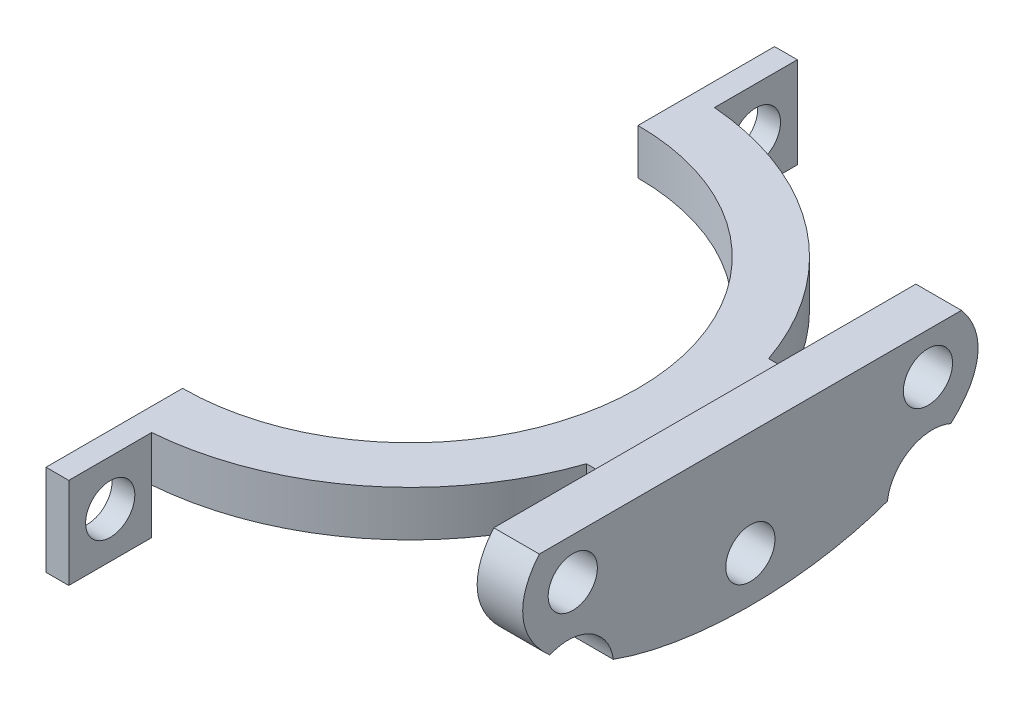
ISO-10303-21;
HEADER;
FILE_DESCRIPTION(('STEP AP214'),'2;1');
FILE_NAME('part.step','',(''),(''),'','','');
FILE_SCHEMA(('AUTOMOTIVE_DESIGN { 1 0 10303 214 1 1 1 1 }'));
ENDSEC;
DATA;
#1=APPLICATION_CONTEXT('core data for automotive mechanical design processes');
#2=APPLICATION_PROTOCOL_DEFINITION('international standard','automotive_design',2000,#1);
#3=PRODUCT_CONTEXT('',#1,'mechanical');
#4=PRODUCT('Part','Part','',(#3));
#5=PRODUCT_RELATED_PRODUCT_CATEGORY('part','',(#4));
#6=PRODUCT_DEFINITION_FORMATION('','',#4);
#7=PRODUCT_DEFINITION_CONTEXT('part definition',#1,'design');
#8=PRODUCT_DEFINITION('design','',#6,#7);
#9=PRODUCT_DEFINITION_SHAPE('','',#8);
#10=(LENGTH_UNIT() NAMED_UNIT(*) SI_UNIT(.MILLI.,.METRE.));
#11=(NAMED_UNIT(*) PLANE_ANGLE_UNIT() SI_UNIT($,.RADIAN.));
#12=(NAMED_UNIT(*) SI_UNIT($,.STERADIAN.) SOLID_ANGLE_UNIT());
#13=UNCERTAINTY_MEASURE_WITH_UNIT(LENGTH_MEASURE(1.E-05),#10,'distance_accuracy_value','');
#14=(GEOMETRIC_REPRESENTATION_CONTEXT(3) GLOBAL_UNCERTAINTY_ASSIGNED_CONTEXT((#13)) GLOBAL_UNIT_ASSIGNED_CONTEXT((#10,
#11,#12)) REPRESENTATION_CONTEXT('',''));
#15=CARTESIAN_POINT('',(0.,0.,0.));
#16=DIRECTION('',(0.,0.,1.));
#17=DIRECTION('',(1.,0.,0.));
#18=AXIS2_PLACEMENT_3D('',#15,#16,#17);
#19=CARTESIAN_POINT('',(32.3428015022424,2.5,0.));
#20=DIRECTION('',(1.,0.,0.));
#21=DIRECTION('',(0.,0.,-1.));
#22=AXIS2_PLACEMENT_3D('',#19,#20,#21);
#23=ELLIPSE('',#22,25.,12.);
#24=DIRECTION('',(1.,0.,0.));
#25=VECTOR('',#24,1.);
#26=SURFACE_OF_LINEAR_EXTRUSION('',#23,#25);
#27=DIRECTION('',(1.,0.,0.));
#28=VECTOR('',#27,1.);
#29=CARTESIAN_POINT('',(32.3428015022424,-7.08344087328634,-15.0458877139792));
#30=LINE('',#29,#28);
#31=CARTESIAN_POINT('',(37.3428015022424,-7.08344087328634,-15.0458877139792));
#32=VERTEX_POINT('',#31);
#33=CARTESIAN_POINT('',(32.3428015022424,-7.08344087328634,-15.0458877139792));
#34=VERTEX_POINT('',#33);
#35=EDGE_CURVE('E238',#32,#34,#30,.F.);
#36=ORIENTED_EDGE('',*,*,#35,.F.);
#37=CARTESIAN_POINT('',(37.3428015022424,2.5,0.));
#38=DIRECTION('',(1.,0.,0.));
#39=DIRECTION('',(0.,0.,-1.));
#40=AXIS2_PLACEMENT_3D('',#37,#38,#39);
#41=ELLIPSE('',#40,25.,12.);
#42=CARTESIAN_POINT('',(37.3428015022424,-7.08344087328633,15.0458877139792));
#43=VERTEX_POINT('',#42);
#44=EDGE_CURVE('E859',#43,#32,#41,.T.);
#45=ORIENTED_EDGE('',*,*,#44,.F.);
#46=DIRECTION('',(1.,0.,0.));
#47=VECTOR('',#46,1.);
#48=CARTESIAN_POINT('',(32.3428015022424,-7.08344087328633,15.0458877139792));
#49=LINE('',#48,#47);
#50=CARTESIAN_POINT('',(32.3428015022424,-7.08344087328633,15.0458877139792));
#51=VERTEX_POINT('',#50);
#52=EDGE_CURVE('E64',#51,#43,#49,.T.);
#53=ORIENTED_EDGE('',*,*,#52,.F.);
#54=EDGE_CURVE('E202',#51,#34,#23,.T.);
#55=ORIENTED_EDGE('',*,*,#54,.T.);
#56=EDGE_LOOP('',(#36,#45,#53,#55));
#57=FACE_BOUND('',#56,.T.);
#58=ADVANCED_FACE('F41',(#57),#26,.T.);
#59=DIRECTION('',(1.,0.,0.));
#60=VECTOR('',#59,1.);
#61=CARTESIAN_POINT('',(32.3428015022424,-3.18429291918994,22.0172767950297));
#62=LINE('',#61,#60);
#63=CARTESIAN_POINT('',(37.3428015022424,-3.18429291918995,22.0172767950297));
#64=VERTEX_POINT('',#63);
#65=CARTESIAN_POINT('',(32.3428015022424,-3.18429291918995,22.0172767950297));
#66=VERTEX_POINT('',#65);
#67=EDGE_CURVE('E182',#64,#66,#62,.F.);
#68=ORIENTED_EDGE('',*,*,#67,.F.);
#69=CARTESIAN_POINT('',(37.3428015022424,6.99999999999998,23.175620272174));
#70=VERTEX_POINT('',#69);
#71=EDGE_CURVE('E850',#70,#64,#41,.T.);
#72=ORIENTED_EDGE('',*,*,#71,.F.);
#73=DIRECTION('',(1.,0.,0.));
#74=VECTOR('',#73,1.);
#75=CARTESIAN_POINT('',(32.3428015022424,6.99999999999998,23.175620272174));
#76=LINE('',#75,#74);
#77=CARTESIAN_POINT('',(32.3428015022424,6.99999999999998,23.175620272174));
#78=VERTEX_POINT('',#77);
#79=EDGE_CURVE('E207',#78,#70,#76,.T.);
#80=ORIENTED_EDGE('',*,*,#79,.F.);
#81=EDGE_CURVE('E199',#78,#66,#23,.T.);
#82=ORIENTED_EDGE('',*,*,#81,.T.);
#83=EDGE_LOOP('',(#68,#72,#80,#82));
#84=FACE_BOUND('',#83,.T.);
#85=ADVANCED_FACE('F206',(#84),#26,.T.);
#86=CARTESIAN_POINT('',(0.,0.,0.));
#87=DIRECTION('',(0.,1.,0.));
#88=DIRECTION('',(0.,0.,1.));
#89=AXIS2_PLACEMENT_3D('',#86,#87,#88);
#90=PLANE('',#89);
#91=DIRECTION('',(0.,0.,-1.));
#92=VECTOR('',#91,1.);
#93=CARTESIAN_POINT('',(32.3428015022424,0.,0.));
#94=LINE('',#93,#92);
#95=CARTESIAN_POINT('',(32.3428015022424,0.,10.));
#96=VERTEX_POINT('',#95);
#97=CARTESIAN_POINT('',(32.3428015022424,0.,-10.));
#98=VERTEX_POINT('',#97);
#99=EDGE_CURVE('E224',#96,#98,#94,.T.);
#100=ORIENTED_EDGE('',*,*,#99,.F.);
#101=DIRECTION('',(-1.,0.,0.));
#102=VECTOR('',#101,1.);
#103=CARTESIAN_POINT('',(0.,0.,10.));
#104=LINE('',#103,#102);
#105=CARTESIAN_POINT('',(29.3428015022424,0.,10.));
#106=VERTEX_POINT('',#105);
#107=EDGE_CURVE('E342',#96,#106,#104,.T.);
#108=ORIENTED_EDGE('',*,*,#107,.T.);
#109=CARTESIAN_POINT('',(0.,0.,0.));
#110=DIRECTION('',(0.,1.,0.));
#111=DIRECTION('',(0.,0.,1.));
#112=AXIS2_PLACEMENT_3D('',#109,#110,#111);
#113=CIRCLE('',#112,31.);
#114=CARTESIAN_POINT('',(2.5,0.,30.8990291109608));
#115=VERTEX_POINT('',#114);
#116=EDGE_CURVE('E395',#115,#106,#113,.T.);
#117=ORIENTED_EDGE('',*,*,#116,.F.);
#118=DIRECTION('',(1.,0.,0.));
#119=VECTOR('',#118,1.);
#120=CARTESIAN_POINT('',(0.,0.,30.8990291109608));
#121=LINE('',#120,#119);
#122=CARTESIAN_POINT('',(0.,0.,30.8990291109608));
#123=VERTEX_POINT('',#122);
#124=EDGE_CURVE('E311',#123,#115,#121,.T.);
#125=ORIENTED_EDGE('',*,*,#124,.F.);
#126=DIRECTION('',(0.,0.,1.));
#127=VECTOR('',#126,1.);
#128=CARTESIAN_POINT('',(0.,0.,0.));
#129=LINE('',#128,#127);
#130=CARTESIAN_POINT('',(0.,0.,25.));
#131=VERTEX_POINT('',#130);
#132=EDGE_CURVE('E391',#131,#123,#129,.T.);
#133=ORIENTED_EDGE('',*,*,#132,.F.);
#134=CARTESIAN_POINT('',(0.,0.,0.));
#135=DIRECTION('',(0.,1.,0.));
#136=DIRECTION('',(0.,0.,1.));
#137=AXIS2_PLACEMENT_3D('',#134,#135,#136);
#138=CIRCLE('',#137,25.);
#139=CARTESIAN_POINT('',(0.,0.,-25.));
#140=VERTEX_POINT('',#139);
#141=EDGE_CURVE('E387',#131,#140,#138,.T.);
#142=ORIENTED_EDGE('',*,*,#141,.T.);
#143=DIRECTION('',(0.,0.,-1.));
#144=VECTOR('',#143,1.);
#145=CARTESIAN_POINT('',(0.,0.,0.));
#146=LINE('',#145,#144);
#147=CARTESIAN_POINT('',(0.,0.,-30.8990291109608));
#148=VERTEX_POINT('',#147);
#149=EDGE_CURVE('E384',#140,#148,#146,.T.);
#150=ORIENTED_EDGE('',*,*,#149,.T.);
#151=DIRECTION('',(-1.,0.,0.));
#152=VECTOR('',#151,1.);
#153=CARTESIAN_POINT('',(0.,0.,-30.8990291109608));
#154=LINE('',#153,#152);
#155=CARTESIAN_POINT('',(2.5,0.,-30.8990291109608));
#156=VERTEX_POINT('',#155);
#157=EDGE_CURVE('E274',#156,#148,#154,.T.);
#158=ORIENTED_EDGE('',*,*,#157,.F.);
#159=CARTESIAN_POINT('',(0.,0.,0.));
#160=DIRECTION('',(0.,1.,0.));
#161=DIRECTION('',(0.,0.,1.));
#162=AXIS2_PLACEMENT_3D('',#159,#160,#161);
#163=CIRCLE('',#162,31.);
#164=CARTESIAN_POINT('',(29.3428015022424,0.,-10.));
#165=VERTEX_POINT('',#164);
#166=EDGE_CURVE('E380',#165,#156,#163,.T.);
#167=ORIENTED_EDGE('',*,*,#166,.F.);
#168=DIRECTION('',(-1.,0.,0.));
#169=VECTOR('',#168,1.);
#170=CARTESIAN_POINT('',(0.,0.,-9.99999999999999));
#171=LINE('',#170,#169);
#172=EDGE_CURVE('E337',#98,#165,#171,.T.);
#173=ORIENTED_EDGE('',*,*,#172,.F.);
#174=EDGE_LOOP('',(#100,#108,#117,#125,#133,#142,#150,#158,#167,#173));
#175=FACE_BOUND('',#174,.T.);
#176=ADVANCED_FACE('F445',(#175),#90,.F.);
#177=CARTESIAN_POINT('',(0.,5.,-9.99999999999999));
#178=DIRECTION('',(0.,0.,1.));
#179=DIRECTION('',(1.,0.,0.));
#180=AXIS2_PLACEMENT_3D('',#177,#178,#179);
#181=PLANE('',#180);
#182=DIRECTION('',(0.,1.,0.));
#183=VECTOR('',#182,1.);
#184=CARTESIAN_POINT('',(32.3428015022424,0.,-10.));
#185=LINE('',#184,#183);
#186=CARTESIAN_POINT('',(32.3428015022424,5.,-10.));
#187=VERTEX_POINT('',#186);
#188=EDGE_CURVE('E229',#98,#187,#185,.T.);
#189=ORIENTED_EDGE('',*,*,#188,.F.);
#190=ORIENTED_EDGE('',*,*,#172,.T.);
#191=DIRECTION('',(0.,-1.,0.));
#192=VECTOR('',#191,1.);
#193=CARTESIAN_POINT('',(29.3428015022424,5.,-10.));
#194=LINE('',#193,#192);
#195=CARTESIAN_POINT('',(29.3428015022424,5.,-10.));
#196=VERTEX_POINT('',#195);
#197=EDGE_CURVE('E430',#196,#165,#194,.T.);
#198=ORIENTED_EDGE('',*,*,#197,.F.);
#199=DIRECTION('',(-1.,0.,0.));
#200=VECTOR('',#199,1.);
#201=CARTESIAN_POINT('',(0.,5.,-9.99999999999999));
#202=LINE('',#201,#200);
#203=EDGE_CURVE('E338',#187,#196,#202,.T.);
#204=ORIENTED_EDGE('',*,*,#203,.F.);
#205=EDGE_LOOP('',(#189,#190,#198,#204));
#206=FACE_BOUND('',#205,.T.);
#207=ADVANCED_FACE('F43',(#206),#181,.F.);
#208=CARTESIAN_POINT('',(0.,5.,10.));
#209=DIRECTION('',(0.,0.,1.));
#210=DIRECTION('',(1.,0.,0.));
#211=AXIS2_PLACEMENT_3D('',#208,#209,#210);
#212=PLANE('',#211);
#213=ORIENTED_EDGE('',*,*,#107,.F.);
#214=DIRECTION('',(0.,-1.,0.));
#215=VECTOR('',#214,1.);
#216=CARTESIAN_POINT('',(32.3428015022424,0.,10.));
#217=LINE('',#216,#215);
#218=CARTESIAN_POINT('',(32.3428015022424,5.,10.));
#219=VERTEX_POINT('',#218);
#220=EDGE_CURVE('E220',#219,#96,#217,.T.);
#221=ORIENTED_EDGE('',*,*,#220,.F.);
#222=DIRECTION('',(-1.,0.,0.));
#223=VECTOR('',#222,1.);
#224=CARTESIAN_POINT('',(0.,5.,10.));
#225=LINE('',#224,#223);
#226=CARTESIAN_POINT('',(29.3428015022424,5.,10.));
#227=VERTEX_POINT('',#226);
#228=EDGE_CURVE('E374',#219,#227,#225,.T.);
#229=ORIENTED_EDGE('',*,*,#228,.T.);
#230=DIRECTION('',(0.,-1.,0.));
#231=VECTOR('',#230,1.);
#232=CARTESIAN_POINT('',(29.3428015022424,5.,10.));
#233=LINE('',#232,#231);
#234=EDGE_CURVE('E377',#227,#106,#233,.T.);
#235=ORIENTED_EDGE('',*,*,#234,.T.);
#236=EDGE_LOOP('',(#213,#221,#229,#235));
#237=FACE_BOUND('',#236,.T.);
#238=ADVANCED_FACE('F494',(#237),#212,.T.);
#239=CARTESIAN_POINT('',(0.,5.,0.));
#240=DIRECTION('',(0.,1.,0.));
#241=DIRECTION('',(0.,0.,1.));
#242=AXIS2_PLACEMENT_3D('',#239,#240,#241);
#243=PLANE('',#242);
#244=ORIENTED_EDGE('',*,*,#228,.F.);
#245=DIRECTION('',(0.,0.,1.));
#246=VECTOR('',#245,1.);
#247=CARTESIAN_POINT('',(32.3428015022424,5.,0.));
#248=LINE('',#247,#246);
#249=EDGE_CURVE('E234',#187,#219,#248,.T.);
#250=ORIENTED_EDGE('',*,*,#249,.F.);
#251=ORIENTED_EDGE('',*,*,#203,.T.);
#252=CARTESIAN_POINT('',(0.,5.,0.));
#253=DIRECTION('',(0.,1.,0.));
#254=DIRECTION('',(0.,0.,1.));
#255=AXIS2_PLACEMENT_3D('',#252,#253,#254);
#256=CIRCLE('',#255,31.);
#257=CARTESIAN_POINT('',(2.5,5.,-30.8990291109608));
#258=VERTEX_POINT('',#257);
#259=EDGE_CURVE('E341',#196,#258,#256,.T.);
#260=ORIENTED_EDGE('',*,*,#259,.T.);
#261=DIRECTION('',(0.,0.,1.));
#262=VECTOR('',#261,1.);
#263=CARTESIAN_POINT('',(2.5,5.,0.));
#264=LINE('',#263,#262);
#265=CARTESIAN_POINT('',(2.5,5.,-40.));
#266=VERTEX_POINT('',#265);
#267=EDGE_CURVE('E345',#266,#258,#264,.T.);
#268=ORIENTED_EDGE('',*,*,#267,.F.);
#269=DIRECTION('',(1.,0.,0.));
#270=VECTOR('',#269,1.);
#271=CARTESIAN_POINT('',(0.,5.,-40.));
#272=LINE('',#271,#270);
#273=CARTESIAN_POINT('',(0.,5.,-40.));
#274=VERTEX_POINT('',#273);
#275=EDGE_CURVE('E349',#274,#266,#272,.T.);
#276=ORIENTED_EDGE('',*,*,#275,.F.);
#277=DIRECTION('',(0.,0.,-1.));
#278=VECTOR('',#277,1.);
#279=CARTESIAN_POINT('',(0.,5.,0.));
#280=LINE('',#279,#278);
#281=CARTESIAN_POINT('',(0.,5.,-25.));
#282=VERTEX_POINT('',#281);
#283=EDGE_CURVE('E353',#282,#274,#280,.T.);
#284=ORIENTED_EDGE('',*,*,#283,.F.);
#285=CARTESIAN_POINT('',(0.,5.,0.));
#286=DIRECTION('',(0.,1.,0.));
#287=DIRECTION('',(0.,0.,1.));
#288=AXIS2_PLACEMENT_3D('',#285,#286,#287);
#289=CIRCLE('',#288,25.);
#290=CARTESIAN_POINT('',(0.,5.,25.));
#291=VERTEX_POINT('',#290);
#292=EDGE_CURVE('E357',#291,#282,#289,.T.);
#293=ORIENTED_EDGE('',*,*,#292,.F.);
#294=DIRECTION('',(0.,0.,1.));
#295=VECTOR('',#294,1.);
#296=CARTESIAN_POINT('',(0.,5.,0.));
#297=LINE('',#296,#295);
#298=CARTESIAN_POINT('',(0.,5.,40.));
#299=VERTEX_POINT('',#298);
#300=EDGE_CURVE('E361',#291,#299,#297,.T.);
#301=ORIENTED_EDGE('',*,*,#300,.T.);
#302=DIRECTION('',(1.,0.,0.));
#303=VECTOR('',#302,1.);
#304=CARTESIAN_POINT('',(0.,5.,40.));
#305=LINE('',#304,#303);
#306=CARTESIAN_POINT('',(2.5,5.,40.));
#307=VERTEX_POINT('',#306);
#308=EDGE_CURVE('E364',#299,#307,#305,.T.);
#309=ORIENTED_EDGE('',*,*,#308,.T.);
#310=DIRECTION('',(0.,0.,-1.));
#311=VECTOR('',#310,1.);
#312=CARTESIAN_POINT('',(2.5,5.,0.));
#313=LINE('',#312,#311);
#314=CARTESIAN_POINT('',(2.5,5.,30.8990291109608));
#315=VERTEX_POINT('',#314);
#316=EDGE_CURVE('E367',#307,#315,#313,.T.);
#317=ORIENTED_EDGE('',*,*,#316,.T.);
#318=CARTESIAN_POINT('',(0.,5.,0.));
#319=DIRECTION('',(0.,1.,0.));
#320=DIRECTION('',(0.,0.,1.));
#321=AXIS2_PLACEMENT_3D('',#318,#319,#320);
#322=CIRCLE('',#321,31.);
#323=EDGE_CURVE('E370',#315,#227,#322,.T.);
#324=ORIENTED_EDGE('',*,*,#323,.T.);
#325=EDGE_LOOP('',(#244,#250,#251,#260,#268,#276,#284,#293,#301,#309,#317,#324));
#326=FACE_BOUND('',#325,.T.);
#327=ADVANCED_FACE('F458',(#326),#243,.T.);
#328=CARTESIAN_POINT('',(0.,5.,0.));
#329=DIRECTION('',(0.,-1.,0.));
#330=DIRECTION('',(0.,0.,-1.));
#331=AXIS2_PLACEMENT_3D('',#328,#329,#330);
#332=CYLINDRICAL_SURFACE('',#331,31.);
#333=ORIENTED_EDGE('',*,*,#166,.T.);
#334=DIRECTION('',(0.,-1.,0.));
#335=VECTOR('',#334,1.);
#336=CARTESIAN_POINT('',(2.5,5.,-30.8990291109608));
#337=LINE('',#336,#335);
#338=EDGE_CURVE('E426',#258,#156,#337,.T.);
#339=ORIENTED_EDGE('',*,*,#338,.F.);
#340=ORIENTED_EDGE('',*,*,#259,.F.);
#341=ORIENTED_EDGE('',*,*,#197,.T.);
#342=EDGE_LOOP('',(#333,#339,#340,#341));
#343=FACE_BOUND('',#342,.T.);
#344=ADVANCED_FACE('F437',(#343),#332,.T.);
#345=CARTESIAN_POINT('',(2.5,5.,0.));
#346=DIRECTION('',(1.,0.,0.));
#347=DIRECTION('',(0.,0.,-1.));
#348=AXIS2_PLACEMENT_3D('',#345,#346,#347);
#349=PLANE('',#348);
#350=CARTESIAN_POINT('',(2.5,0.,-35.4495145554804));
#351=DIRECTION('',(1.,0.,0.));
#352=DIRECTION('',(0.,0.,-1.));
#353=AXIS2_PLACEMENT_3D('',#350,#351,#352);
#354=CIRCLE('',#353,2.7);
#355=CARTESIAN_POINT('',(2.5,0.,-38.1495145554804));
#356=VERTEX_POINT('',#355);
#357=EDGE_CURVE('E275',#356,#356,#354,.F.);
#358=ORIENTED_EDGE('',*,*,#357,.T.);
#359=EDGE_LOOP('',(#358));
#360=FACE_BOUND('',#359,.T.);
#361=ORIENTED_EDGE('',*,*,#338,.T.);
#362=DIRECTION('',(0.,1.,0.));
#363=VECTOR('',#362,1.);
#364=CARTESIAN_POINT('',(2.5,-5.,-30.8990291109608));
#365=LINE('',#364,#363);
#366=CARTESIAN_POINT('',(2.5,-5.,-30.8990291109608));
#367=VERTEX_POINT('',#366);
#368=EDGE_CURVE('E307',#367,#156,#365,.T.);
#369=ORIENTED_EDGE('',*,*,#368,.F.);
#370=DIRECTION('',(0.,0.,1.));
#371=VECTOR('',#370,1.);
#372=CARTESIAN_POINT('',(2.5,-5.,-30.8990291109608));
#373=LINE('',#372,#371);
#374=CARTESIAN_POINT('',(2.5,-5.,-40.));
#375=VERTEX_POINT('',#374);
#376=EDGE_CURVE('E294',#375,#367,#373,.T.);
#377=ORIENTED_EDGE('',*,*,#376,.F.);
#378=DIRECTION('',(0.,-1.,0.));
#379=VECTOR('',#378,1.);
#380=CARTESIAN_POINT('',(2.5,5.,-40.));
#381=LINE('',#380,#379);
#382=EDGE_CURVE('E423',#266,#375,#381,.T.);
#383=ORIENTED_EDGE('',*,*,#382,.F.);
#384=ORIENTED_EDGE('',*,*,#267,.T.);
#385=EDGE_LOOP('',(#361,#369,#377,#383,#384));
#386=FACE_BOUND('',#385,.T.);
#387=ADVANCED_FACE('F451',(#360,#386),#349,.T.);
#388=CARTESIAN_POINT('',(0.,5.,-40.));
#389=DIRECTION('',(0.,0.,-1.));
#390=DIRECTION('',(-1.,0.,0.));
#391=AXIS2_PLACEMENT_3D('',#388,#389,#390);
#392=PLANE('',#391);
#393=ORIENTED_EDGE('',*,*,#382,.T.);
#394=DIRECTION('',(1.,0.,0.));
#395=VECTOR('',#394,1.);
#396=CARTESIAN_POINT('',(0.,-5.,-40.));
#397=LINE('',#396,#395);
#398=CARTESIAN_POINT('',(0.,-5.,-40.));
#399=VERTEX_POINT('',#398);
#400=EDGE_CURVE('E290',#399,#375,#397,.T.);
#401=ORIENTED_EDGE('',*,*,#400,.F.);
#402=DIRECTION('',(0.,-1.,0.));
#403=VECTOR('',#402,1.);
#404=CARTESIAN_POINT('',(0.,5.,-40.));
#405=LINE('',#404,#403);
#406=EDGE_CURVE('E420',#274,#399,#405,.T.);
#407=ORIENTED_EDGE('',*,*,#406,.F.);
#408=ORIENTED_EDGE('',*,*,#275,.T.);
#409=EDGE_LOOP('',(#393,#401,#407,#408));
#410=FACE_BOUND('',#409,.T.);
#411=ADVANCED_FACE('F461',(#410),#392,.T.);
#412=CARTESIAN_POINT('',(0.,5.,0.));
#413=DIRECTION('',(-1.,0.,0.));
#414=DIRECTION('',(0.,0.,1.));
#415=AXIS2_PLACEMENT_3D('',#412,#413,#414);
#416=PLANE('',#415);
#417=CARTESIAN_POINT('',(0.,0.,-35.4495145554804));
#418=DIRECTION('',(-1.,0.,0.));
#419=DIRECTION('',(0.,0.,1.));
#420=AXIS2_PLACEMENT_3D('',#417,#418,#419);
#421=CIRCLE('',#420,2.7);
#422=CARTESIAN_POINT('',(0.,0.,-32.7495145554804));
#423=VERTEX_POINT('',#422);
#424=EDGE_CURVE('E270',#423,#423,#421,.T.);
#425=ORIENTED_EDGE('',*,*,#424,.F.);
#426=EDGE_LOOP('',(#425));
#427=FACE_BOUND('',#426,.T.);
#428=ORIENTED_EDGE('',*,*,#149,.F.);
#429=DIRECTION('',(0.,-1.,0.));
#430=VECTOR('',#429,1.);
#431=CARTESIAN_POINT('',(0.,5.,-25.));
#432=LINE('',#431,#430);
#433=EDGE_CURVE('E417',#282,#140,#432,.T.);
#434=ORIENTED_EDGE('',*,*,#433,.F.);
#435=ORIENTED_EDGE('',*,*,#283,.T.);
#436=ORIENTED_EDGE('',*,*,#406,.T.);
#437=DIRECTION('',(0.,0.,-1.));
#438=VECTOR('',#437,1.);
#439=CARTESIAN_POINT('',(0.,-5.,-30.8990291109608));
#440=LINE('',#439,#438);
#441=CARTESIAN_POINT('',(0.,-5.,-30.8990291109608));
#442=VERTEX_POINT('',#441);
#443=EDGE_CURVE('E286',#442,#399,#440,.T.);
#444=ORIENTED_EDGE('',*,*,#443,.F.);
#445=DIRECTION('',(0.,1.,0.));
#446=VECTOR('',#445,1.);
#447=CARTESIAN_POINT('',(0.,-5.,-30.8990291109608));
#448=LINE('',#447,#446);
#449=EDGE_CURVE('E300',#442,#148,#448,.T.);
#450=ORIENTED_EDGE('',*,*,#449,.T.);
#451=EDGE_LOOP('',(#428,#434,#435,#436,#444,#450));
#452=FACE_BOUND('',#451,.T.);
#453=ADVANCED_FACE('F465',(#427,#452),#416,.T.);
#454=CARTESIAN_POINT('',(0.,5.,0.));
#455=DIRECTION('',(0.,-1.,0.));
#456=DIRECTION('',(0.,0.,-1.));
#457=AXIS2_PLACEMENT_3D('',#454,#455,#456);
#458=CYLINDRICAL_SURFACE('',#457,25.);
#459=ORIENTED_EDGE('',*,*,#141,.F.);
#460=DIRECTION('',(0.,-1.,0.));
#461=VECTOR('',#460,1.);
#462=CARTESIAN_POINT('',(0.,5.,25.));
#463=LINE('',#462,#461);
#464=EDGE_CURVE('E414',#291,#131,#463,.T.);
#465=ORIENTED_EDGE('',*,*,#464,.F.);
#466=ORIENTED_EDGE('',*,*,#292,.T.);
#467=ORIENTED_EDGE('',*,*,#433,.T.);
#468=EDGE_LOOP('',(#459,#465,#466,#467));
#469=FACE_BOUND('',#468,.T.);
#470=ADVANCED_FACE('F469',(#469),#458,.F.);
#471=CARTESIAN_POINT('',(0.,5.,0.));
#472=DIRECTION('',(1.,0.,0.));
#473=DIRECTION('',(0.,0.,-1.));
#474=AXIS2_PLACEMENT_3D('',#471,#472,#473);
#475=PLANE('',#474);
#476=CARTESIAN_POINT('',(0.,0.,35.4495145554804));
#477=DIRECTION('',(1.,0.,0.));
#478=DIRECTION('',(0.,0.,-1.));
#479=AXIS2_PLACEMENT_3D('',#476,#477,#478);
#480=CIRCLE('',#479,2.7);
#481=CARTESIAN_POINT('',(0.,0.,32.7495145554804));
#482=VERTEX_POINT('',#481);
#483=EDGE_CURVE('E263',#482,#482,#480,.T.);
#484=ORIENTED_EDGE('',*,*,#483,.T.);
#485=EDGE_LOOP('',(#484));
#486=FACE_BOUND('',#485,.T.);
#487=ORIENTED_EDGE('',*,*,#132,.T.);
#488=DIRECTION('',(0.,1.,0.));
#489=VECTOR('',#488,1.);
#490=CARTESIAN_POINT('',(0.,-5.,30.8990291109608));
#491=LINE('',#490,#489);
#492=CARTESIAN_POINT('',(0.,-5.,30.8990291109608));
#493=VERTEX_POINT('',#492);
#494=EDGE_CURVE('E333',#493,#123,#491,.T.);
#495=ORIENTED_EDGE('',*,*,#494,.F.);
#496=DIRECTION('',(0.,0.,-1.));
#497=VECTOR('',#496,1.);
#498=CARTESIAN_POINT('',(0.,-5.,30.8990291109608));
#499=LINE('',#498,#497);
#500=CARTESIAN_POINT('',(0.,-5.,40.));
#501=VERTEX_POINT('',#500);
#502=EDGE_CURVE('E320',#501,#493,#499,.T.);
#503=ORIENTED_EDGE('',*,*,#502,.F.);
#504=DIRECTION('',(0.,-1.,0.));
#505=VECTOR('',#504,1.);
#506=CARTESIAN_POINT('',(0.,5.,40.));
#507=LINE('',#506,#505);
#508=EDGE_CURVE('E411',#299,#501,#507,.T.);
#509=ORIENTED_EDGE('',*,*,#508,.F.);
#510=ORIENTED_EDGE('',*,*,#300,.F.);
#511=ORIENTED_EDGE('',*,*,#464,.T.);
#512=EDGE_LOOP('',(#487,#495,#503,#509,#510,#511));
#513=FACE_BOUND('',#512,.T.);
#514=ADVANCED_FACE('F474',(#486,#513),#475,.F.);
#515=CARTESIAN_POINT('',(0.,5.,40.));
#516=DIRECTION('',(0.,0.,-1.));
#517=DIRECTION('',(-1.,0.,0.));
#518=AXIS2_PLACEMENT_3D('',#515,#516,#517);
#519=PLANE('',#518);
#520=ORIENTED_EDGE('',*,*,#508,.T.);
#521=DIRECTION('',(-1.,0.,0.));
#522=VECTOR('',#521,1.);
#523=CARTESIAN_POINT('',(0.,-5.,40.));
#524=LINE('',#523,#522);
#525=CARTESIAN_POINT('',(2.5,-5.,40.));
#526=VERTEX_POINT('',#525);
#527=EDGE_CURVE('E316',#526,#501,#524,.T.);
#528=ORIENTED_EDGE('',*,*,#527,.F.);
#529=DIRECTION('',(0.,-1.,0.));
#530=VECTOR('',#529,1.);
#531=CARTESIAN_POINT('',(2.5,5.,40.));
#532=LINE('',#531,#530);
#533=EDGE_CURVE('E408',#307,#526,#532,.T.);
#534=ORIENTED_EDGE('',*,*,#533,.F.);
#535=ORIENTED_EDGE('',*,*,#308,.F.);
#536=EDGE_LOOP('',(#520,#528,#534,#535));
#537=FACE_BOUND('',#536,.T.);
#538=ADVANCED_FACE('F482',(#537),#519,.F.);
#539=CARTESIAN_POINT('',(2.5,5.,0.));
#540=DIRECTION('',(-1.,0.,0.));
#541=DIRECTION('',(0.,0.,1.));
#542=AXIS2_PLACEMENT_3D('',#539,#540,#541);
#543=PLANE('',#542);
#544=CARTESIAN_POINT('',(2.5,0.,35.4495145554804));
#545=DIRECTION('',(-1.,0.,0.));
#546=DIRECTION('',(0.,0.,1.));
#547=AXIS2_PLACEMENT_3D('',#544,#545,#546);
#548=CIRCLE('',#547,2.7);
#549=CARTESIAN_POINT('',(2.5,0.,38.1495145554804));
#550=VERTEX_POINT('',#549);
#551=EDGE_CURVE('E279',#550,#550,#548,.T.);
#552=ORIENTED_EDGE('',*,*,#551,.T.);
#553=EDGE_LOOP('',(#552));
#554=FACE_BOUND('',#553,.T.);
#555=ORIENTED_EDGE('',*,*,#533,.T.);
#556=DIRECTION('',(0.,0.,1.));
#557=VECTOR('',#556,1.);
#558=CARTESIAN_POINT('',(2.5,-5.,30.8990291109608));
#559=LINE('',#558,#557);
#560=CARTESIAN_POINT('',(2.5,-5.,30.8990291109608));
#561=VERTEX_POINT('',#560);
#562=EDGE_CURVE('E312',#561,#526,#559,.T.);
#563=ORIENTED_EDGE('',*,*,#562,.F.);
#564=DIRECTION('',(0.,1.,0.));
#565=VECTOR('',#564,1.);
#566=CARTESIAN_POINT('',(2.5,-5.,30.8990291109608));
#567=LINE('',#566,#565);
#568=EDGE_CURVE('E326',#561,#115,#567,.T.);
#569=ORIENTED_EDGE('',*,*,#568,.T.);
#570=DIRECTION('',(0.,-1.,0.));
#571=VECTOR('',#570,1.);
#572=CARTESIAN_POINT('',(2.5,5.,30.8990291109608));
#573=LINE('',#572,#571);
#574=EDGE_CURVE('E404',#315,#115,#573,.T.);
#575=ORIENTED_EDGE('',*,*,#574,.F.);
#576=ORIENTED_EDGE('',*,*,#316,.F.);
#577=EDGE_LOOP('',(#555,#563,#569,#575,#576));
#578=FACE_BOUND('',#577,.T.);
#579=ADVANCED_FACE('F485',(#554,#578),#543,.F.);
#580=CARTESIAN_POINT('',(0.,5.,0.));
#581=DIRECTION('',(0.,-1.,0.));
#582=DIRECTION('',(0.,0.,-1.));
#583=AXIS2_PLACEMENT_3D('',#580,#581,#582);
#584=CYLINDRICAL_SURFACE('',#583,31.);
#585=ORIENTED_EDGE('',*,*,#116,.T.);
#586=ORIENTED_EDGE('',*,*,#234,.F.);
#587=ORIENTED_EDGE('',*,*,#323,.F.);
#588=ORIENTED_EDGE('',*,*,#574,.T.);
#589=EDGE_LOOP('',(#585,#586,#587,#588));
#590=FACE_BOUND('',#589,.T.);
#591=ADVANCED_FACE('F490',(#590),#584,.T.);
#592=CARTESIAN_POINT('',(0.,-5.,30.8990291109608));
#593=DIRECTION('',(0.,0.,1.));
#594=DIRECTION('',(1.,0.,0.));
#595=AXIS2_PLACEMENT_3D('',#592,#593,#594);
#596=PLANE('',#595);
#597=ORIENTED_EDGE('',*,*,#124,.T.);
#598=ORIENTED_EDGE('',*,*,#568,.F.);
#599=DIRECTION('',(1.,0.,0.));
#600=VECTOR('',#599,1.);
#601=CARTESIAN_POINT('',(0.,-5.,30.8990291109608));
#602=LINE('',#601,#600);
#603=EDGE_CURVE('E323',#493,#561,#602,.T.);
#604=ORIENTED_EDGE('',*,*,#603,.F.);
#605=ORIENTED_EDGE('',*,*,#494,.T.);
#606=EDGE_LOOP('',(#597,#598,#604,#605));
#607=FACE_BOUND('',#606,.T.);
#608=ADVANCED_FACE('F546',(#607),#596,.F.);
#609=CARTESIAN_POINT('',(0.,-5.,0.));
#610=DIRECTION('',(0.,1.,0.));
#611=DIRECTION('',(0.,0.,1.));
#612=AXIS2_PLACEMENT_3D('',#609,#610,#611);
#613=PLANE('',#612);
#614=ORIENTED_EDGE('',*,*,#562,.T.);
#615=ORIENTED_EDGE('',*,*,#527,.T.);
#616=ORIENTED_EDGE('',*,*,#502,.T.);
#617=ORIENTED_EDGE('',*,*,#603,.T.);
#618=EDGE_LOOP('',(#614,#615,#616,#617));
#619=FACE_BOUND('',#618,.T.);
#620=ADVANCED_FACE('F543',(#619),#613,.F.);
#621=CARTESIAN_POINT('',(0.,-5.,-30.8990291109608));
#622=DIRECTION('',(0.,0.,-1.));
#623=DIRECTION('',(-1.,0.,0.));
#624=AXIS2_PLACEMENT_3D('',#621,#622,#623);
#625=PLANE('',#624);
#626=ORIENTED_EDGE('',*,*,#157,.T.);
#627=ORIENTED_EDGE('',*,*,#449,.F.);
#628=DIRECTION('',(-1.,0.,0.));
#629=VECTOR('',#628,1.);
#630=CARTESIAN_POINT('',(0.,-5.,-30.8990291109608));
#631=LINE('',#630,#629);
#632=EDGE_CURVE('E297',#367,#442,#631,.T.);
#633=ORIENTED_EDGE('',*,*,#632,.F.);
#634=ORIENTED_EDGE('',*,*,#368,.T.);
#635=EDGE_LOOP('',(#626,#627,#633,#634));
#636=FACE_BOUND('',#635,.T.);
#637=ADVANCED_FACE('F539',(#636),#625,.F.);
#638=CARTESIAN_POINT('',(0.,-5.,0.));
#639=DIRECTION('',(0.,-1.,0.));
#640=DIRECTION('',(0.,0.,-1.));
#641=AXIS2_PLACEMENT_3D('',#638,#639,#640);
#642=PLANE('',#641);
#643=ORIENTED_EDGE('',*,*,#443,.T.);
#644=ORIENTED_EDGE('',*,*,#400,.T.);
#645=ORIENTED_EDGE('',*,*,#376,.T.);
#646=ORIENTED_EDGE('',*,*,#632,.T.);
#647=EDGE_LOOP('',(#643,#644,#645,#646));
#648=FACE_BOUND('',#647,.T.);
#649=ADVANCED_FACE('F531',(#648),#642,.T.);
#650=CARTESIAN_POINT('',(37.3438015022424,0.,35.4495145554804));
#651=DIRECTION('',(-1.,0.,0.));
#652=DIRECTION('',(0.,0.,1.));
#653=AXIS2_PLACEMENT_3D('',#650,#651,#652);
#654=CYLINDRICAL_SURFACE('',#653,2.7);
#655=ORIENTED_EDGE('',*,*,#483,.F.);
#656=EDGE_LOOP('',(#655));
#657=FACE_BOUND('',#656,.T.);
#658=ORIENTED_EDGE('',*,*,#551,.F.);
#659=EDGE_LOOP('',(#658));
#660=FACE_BOUND('',#659,.T.);
#661=ADVANCED_FACE('F526',(#657,#660),#654,.F.);
#662=CARTESIAN_POINT('',(37.3438015022424,0.,-35.4495145554804));
#663=DIRECTION('',(-1.,0.,0.));
#664=DIRECTION('',(0.,0.,1.));
#665=AXIS2_PLACEMENT_3D('',#662,#663,#664);
#666=CYLINDRICAL_SURFACE('',#665,2.7);
#667=ORIENTED_EDGE('',*,*,#357,.F.);
#668=EDGE_LOOP('',(#667));
#669=FACE_BOUND('',#668,.T.);
#670=ORIENTED_EDGE('',*,*,#424,.T.);
#671=EDGE_LOOP('',(#670));
#672=FACE_BOUND('',#671,.T.);
#673=ADVANCED_FACE('F518',(#669,#672),#666,.F.);
#674=DIRECTION('',(1.,0.,0.));
#675=VECTOR('',#674,1.);
#676=CARTESIAN_POINT('',(32.3428015022424,-3.18429291918997,-22.0172767950297));
#677=LINE('',#676,#675);
#678=CARTESIAN_POINT('',(32.3428015022424,-3.18429291918996,-22.0172767950297));
#679=VERTEX_POINT('',#678);
#680=CARTESIAN_POINT('',(37.3428015022424,-3.18429291918997,-22.0172767950297));
#681=VERTEX_POINT('',#680);
#682=EDGE_CURVE('E56',#679,#681,#677,.T.);
#683=ORIENTED_EDGE('',*,*,#682,.F.);
#684=CARTESIAN_POINT('',(32.3428015022424,6.99999999999998,-23.175620272174));
#685=VERTEX_POINT('',#684);
#686=EDGE_CURVE('E212',#679,#685,#23,.T.);
#687=ORIENTED_EDGE('',*,*,#686,.T.);
#688=DIRECTION('',(1.,0.,0.));
#689=VECTOR('',#688,1.);
#690=CARTESIAN_POINT('',(32.3428015022424,6.99999999999998,-23.175620272174));
#691=LINE('',#690,#689);
#692=CARTESIAN_POINT('',(37.3428015022424,6.99999999999998,-23.175620272174));
#693=VERTEX_POINT('',#692);
#694=EDGE_CURVE('E254',#685,#693,#691,.T.);
#695=ORIENTED_EDGE('',*,*,#694,.T.);
#696=EDGE_CURVE('E241',#681,#693,#41,.T.);
#697=ORIENTED_EDGE('',*,*,#696,.F.);
#698=EDGE_LOOP('',(#683,#687,#695,#697));
#699=FACE_BOUND('',#698,.T.);
#700=ADVANCED_FACE('F250',(#699),#26,.T.);
#701=CARTESIAN_POINT('',(32.3428015022424,-4.5,0.));
#702=DIRECTION('',(1.,0.,0.));
#703=DIRECTION('',(0.,0.,-1.));
#704=AXIS2_PLACEMENT_3D('',#701,#702,#703);
#705=CYLINDRICAL_SURFACE('',#704,2.7);
#706=CARTESIAN_POINT('',(32.3428015022424,-4.5,0.));
#707=DIRECTION('',(1.,0.,0.));
#708=DIRECTION('',(0.,0.,-1.));
#709=AXIS2_PLACEMENT_3D('',#706,#707,#708);
#710=CIRCLE('',#709,2.7);
#711=CARTESIAN_POINT('',(32.3428015022424,-4.5,-2.7));
#712=VERTEX_POINT('',#711);
#713=EDGE_CURVE('E266',#712,#712,#710,.F.);
#714=ORIENTED_EDGE('',*,*,#713,.T.);
#715=EDGE_LOOP('',(#714));
#716=FACE_BOUND('',#715,.T.);
#717=CARTESIAN_POINT('',(37.3428015022424,-4.5,0.));
#718=DIRECTION('',(1.,0.,0.));
#719=DIRECTION('',(0.,0.,-1.));
#720=AXIS2_PLACEMENT_3D('',#717,#718,#719);
#721=CIRCLE('',#720,2.7);
#722=CARTESIAN_POINT('',(37.3428015022424,-4.5,-2.7));
#723=VERTEX_POINT('',#722);
#724=EDGE_CURVE('E844',#723,#723,#721,.F.);
#725=ORIENTED_EDGE('',*,*,#724,.F.);
#726=EDGE_LOOP('',(#725));
#727=FACE_BOUND('',#726,.T.);
#728=ADVANCED_FACE('F517',(#716,#727),#705,.F.);
#729=CARTESIAN_POINT('',(32.3428015022424,2.5,19.5));
#730=DIRECTION('',(1.,0.,0.));
#731=DIRECTION('',(0.,0.,-1.));
#732=AXIS2_PLACEMENT_3D('',#729,#730,#731);
#733=CYLINDRICAL_SURFACE('',#732,2.7);
#734=CARTESIAN_POINT('',(32.3428015022424,2.5,19.5));
#735=DIRECTION('',(1.,0.,0.));
#736=DIRECTION('',(0.,0.,-1.));
#737=AXIS2_PLACEMENT_3D('',#734,#735,#736);
#738=CIRCLE('',#737,2.7);
#739=CARTESIAN_POINT('',(32.3428015022424,2.5,16.8));
#740=VERTEX_POINT('',#739);
#741=EDGE_CURVE('E215',#740,#740,#738,.T.);
#742=ORIENTED_EDGE('',*,*,#741,.F.);
#743=EDGE_LOOP('',(#742));
#744=FACE_BOUND('',#743,.T.);
#745=CARTESIAN_POINT('',(37.3428015022424,2.5,19.5));
#746=DIRECTION('',(1.,0.,0.));
#747=DIRECTION('',(0.,0.,-1.));
#748=AXIS2_PLACEMENT_3D('',#745,#746,#747);
#749=CIRCLE('',#748,2.7);
#750=CARTESIAN_POINT('',(37.3428015022424,2.5,16.8));
#751=VERTEX_POINT('',#750);
#752=EDGE_CURVE('E841',#751,#751,#749,.T.);
#753=ORIENTED_EDGE('',*,*,#752,.T.);
#754=EDGE_LOOP('',(#753));
#755=FACE_BOUND('',#754,.T.);
#756=ADVANCED_FACE('F523',(#744,#755),#733,.F.);
#757=CARTESIAN_POINT('',(32.3428015022424,6.99999999999998,0.));
#758=DIRECTION('',(0.,-1.,0.));
#759=DIRECTION('',(0.,0.,-1.));
#760=AXIS2_PLACEMENT_3D('',#757,#758,#759);
#761=PLANE('',#760);
#762=DIRECTION('',(0.,0.,-1.));
#763=VECTOR('',#762,1.);
#764=CARTESIAN_POINT('',(37.3428015022424,6.99999999999998,0.));
#765=LINE('',#764,#763);
#766=EDGE_CURVE('E257',#70,#693,#765,.T.);
#767=ORIENTED_EDGE('',*,*,#766,.T.);
#768=ORIENTED_EDGE('',*,*,#694,.F.);
#769=DIRECTION('',(0.,0.,-1.));
#770=VECTOR('',#769,1.);
#771=CARTESIAN_POINT('',(32.3428015022424,6.99999999999998,0.));
#772=LINE('',#771,#770);
#773=EDGE_CURVE('E210',#78,#685,#772,.T.);
#774=ORIENTED_EDGE('',*,*,#773,.F.);
#775=ORIENTED_EDGE('',*,*,#79,.T.);
#776=EDGE_LOOP('',(#767,#768,#774,#775));
#777=FACE_BOUND('',#776,.T.);
#778=ADVANCED_FACE('F255',(#777),#761,.F.);
#779=CARTESIAN_POINT('',(32.3428015022424,2.5,-19.5));
#780=DIRECTION('',(1.,0.,0.));
#781=DIRECTION('',(0.,0.,-1.));
#782=AXIS2_PLACEMENT_3D('',#779,#780,#781);
#783=CYLINDRICAL_SURFACE('',#782,2.7);
#784=CARTESIAN_POINT('',(32.3428015022424,2.5,-19.5));
#785=DIRECTION('',(1.,0.,0.));
#786=DIRECTION('',(0.,0.,-1.));
#787=AXIS2_PLACEMENT_3D('',#784,#785,#786);
#788=CIRCLE('',#787,2.7);
#789=CARTESIAN_POINT('',(32.3428015022424,2.5,-22.2));
#790=VERTEX_POINT('',#789);
#791=EDGE_CURVE('E259',#790,#790,#788,.F.);
#792=ORIENTED_EDGE('',*,*,#791,.T.);
#793=EDGE_LOOP('',(#792));
#794=FACE_BOUND('',#793,.T.);
#795=CARTESIAN_POINT('',(37.3428015022424,2.5,-19.5));
#796=DIRECTION('',(1.,0.,0.));
#797=DIRECTION('',(0.,0.,-1.));
#798=AXIS2_PLACEMENT_3D('',#795,#796,#797);
#799=CIRCLE('',#798,2.7);
#800=CARTESIAN_POINT('',(37.3428015022424,2.5,-22.2));
#801=VERTEX_POINT('',#800);
#802=EDGE_CURVE('E237',#801,#801,#799,.F.);
#803=ORIENTED_EDGE('',*,*,#802,.F.);
#804=EDGE_LOOP('',(#803));
#805=FACE_BOUND('',#804,.T.);
#806=ADVANCED_FACE('F497',(#794,#805),#783,.F.);
#807=CARTESIAN_POINT('',(32.3428015022424,0.,0.));
#808=DIRECTION('',(1.,0.,0.));
#809=DIRECTION('',(0.,0.,-1.));
#810=AXIS2_PLACEMENT_3D('',#807,#808,#809);
#811=PLANE('',#810);
#812=ORIENTED_EDGE('',*,*,#249,.T.);
#813=ORIENTED_EDGE('',*,*,#220,.T.);
#814=ORIENTED_EDGE('',*,*,#99,.T.);
#815=ORIENTED_EDGE('',*,*,#188,.T.);
#816=EDGE_LOOP('',(#812,#813,#814,#815));
#817=FACE_BOUND('',#816,.T.);
#818=ORIENTED_EDGE('',*,*,#686,.F.);
#819=CARTESIAN_POINT('',(32.3428015022424,-7.75928956752039,-20.));
#820=DIRECTION('',(-1.,0.,0.));
#821=DIRECTION('',(0.,0.,1.));
#822=AXIS2_PLACEMENT_3D('',#819,#820,#821);
#823=CIRCLE('',#822,5.);
#824=EDGE_CURVE('E204',#34,#679,#823,.T.);
#825=ORIENTED_EDGE('',*,*,#824,.F.);
#826=ORIENTED_EDGE('',*,*,#54,.F.);
#827=CARTESIAN_POINT('',(32.3428015022424,-7.75928956752039,20.));
#828=DIRECTION('',(-1.,0.,0.));
#829=DIRECTION('',(0.,0.,1.));
#830=AXIS2_PLACEMENT_3D('',#827,#828,#829);
#831=CIRCLE('',#830,5.);
#832=EDGE_CURVE('E185',#66,#51,#831,.T.);
#833=ORIENTED_EDGE('',*,*,#832,.F.);
#834=ORIENTED_EDGE('',*,*,#81,.F.);
#835=ORIENTED_EDGE('',*,*,#773,.T.);
#836=EDGE_LOOP('',(#818,#825,#826,#833,#834,#835));
#837=FACE_BOUND('',#836,.T.);
#838=ORIENTED_EDGE('',*,*,#741,.T.);
#839=EDGE_LOOP('',(#838));
#840=FACE_BOUND('',#839,.T.);
#841=ORIENTED_EDGE('',*,*,#713,.F.);
#842=EDGE_LOOP('',(#841));
#843=FACE_BOUND('',#842,.T.);
#844=ORIENTED_EDGE('',*,*,#791,.F.);
#845=EDGE_LOOP('',(#844));
#846=FACE_BOUND('',#845,.T.);
#847=ADVANCED_FACE('F196',(#817,#837,#840,#843,#846),#811,.F.);
#848=CARTESIAN_POINT('',(37.3428015022424,5.,0.));
#849=DIRECTION('',(1.,0.,0.));
#850=DIRECTION('',(0.,0.,-1.));
#851=AXIS2_PLACEMENT_3D('',#848,#849,#850);
#852=PLANE('',#851);
#853=CARTESIAN_POINT('',(37.3428015022424,-7.75928956752039,-20.));
#854=DIRECTION('',(1.,0.,0.));
#855=DIRECTION('',(0.,0.,-1.));
#856=AXIS2_PLACEMENT_3D('',#853,#854,#855);
#857=CIRCLE('',#856,5.);
#858=EDGE_CURVE('E11',#681,#32,#857,.T.);
#859=ORIENTED_EDGE('',*,*,#858,.F.);
#860=ORIENTED_EDGE('',*,*,#696,.T.);
#861=ORIENTED_EDGE('',*,*,#766,.F.);
#862=ORIENTED_EDGE('',*,*,#71,.T.);
#863=CARTESIAN_POINT('',(37.3428015022424,-7.75928956752039,20.));
#864=DIRECTION('',(1.,0.,0.));
#865=DIRECTION('',(0.,0.,-1.));
#866=AXIS2_PLACEMENT_3D('',#863,#864,#865);
#867=CIRCLE('',#866,5.);
#868=EDGE_CURVE('E50',#43,#64,#867,.T.);
#869=ORIENTED_EDGE('',*,*,#868,.F.);
#870=ORIENTED_EDGE('',*,*,#44,.T.);
#871=EDGE_LOOP('',(#859,#860,#861,#862,#869,#870));
#872=FACE_BOUND('',#871,.T.);
#873=ORIENTED_EDGE('',*,*,#752,.F.);
#874=EDGE_LOOP('',(#873));
#875=FACE_BOUND('',#874,.T.);
#876=ORIENTED_EDGE('',*,*,#724,.T.);
#877=EDGE_LOOP('',(#876));
#878=FACE_BOUND('',#877,.T.);
#879=ORIENTED_EDGE('',*,*,#802,.T.);
#880=EDGE_LOOP('',(#879));
#881=FACE_BOUND('',#880,.T.);
#882=ADVANCED_FACE('F496',(#872,#875,#878,#881),#852,.T.);
#883=CARTESIAN_POINT('',(42.3428015022424,-7.75928956752039,20.));
#884=DIRECTION('',(-1.,0.,0.));
#885=DIRECTION('',(0.,0.,1.));
#886=AXIS2_PLACEMENT_3D('',#883,#884,#885);
#887=CYLINDRICAL_SURFACE('',#886,5.);
#888=ORIENTED_EDGE('',*,*,#67,.T.);
#889=ORIENTED_EDGE('',*,*,#832,.T.);
#890=ORIENTED_EDGE('',*,*,#52,.T.);
#891=ORIENTED_EDGE('',*,*,#868,.T.);
#892=EDGE_LOOP('',(#888,#889,#890,#891));
#893=FACE_BOUND('',#892,.T.);
#894=ADVANCED_FACE('F184',(#893),#887,.F.);
#895=CARTESIAN_POINT('',(42.3428015022424,-7.75928956752039,-20.));
#896=DIRECTION('',(-1.,0.,0.));
#897=DIRECTION('',(0.,0.,1.));
#898=AXIS2_PLACEMENT_3D('',#895,#896,#897);
#899=CYLINDRICAL_SURFACE('',#898,5.);
#900=ORIENTED_EDGE('',*,*,#35,.T.);
#901=ORIENTED_EDGE('',*,*,#824,.T.);
#902=ORIENTED_EDGE('',*,*,#682,.T.);
#903=ORIENTED_EDGE('',*,*,#858,.T.);
#904=EDGE_LOOP('',(#900,#901,#902,#903));
#905=FACE_BOUND('',#904,.T.);
#906=ADVANCED_FACE('F247',(#905),#899,.F.);
#907=CLOSED_SHELL('',(#58,#85,#176,#207,#238,#327,#344,#387,#411,#453,#470,#514,#538,#579,#591,
#608,#620,#637,#649,#661,#673,#700,#728,#756,#778,#806,#847,#882,#894,#906));
#908=MANIFOLD_SOLID_BREP('B2',#907);
#909=ADVANCED_BREP_SHAPE_REPRESENTATION('',(#18,#908),#14);
#910=SHAPE_DEFINITION_REPRESENTATION(#9,#909);
ENDSEC;
END-ISO-10303-21;
